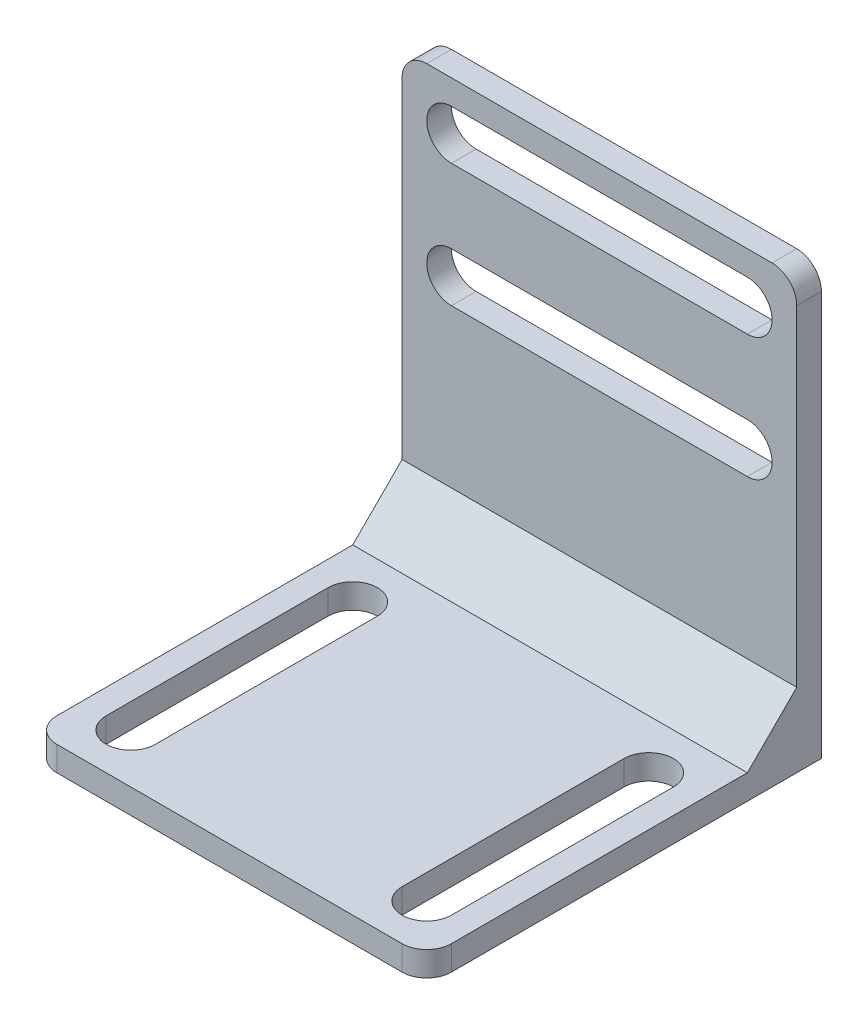
ISO-10303-21;
HEADER;
FILE_DESCRIPTION(('STEP AP214'),'2;1');
FILE_NAME('part.step','',(''),(''),'','','');
FILE_SCHEMA(('AUTOMOTIVE_DESIGN { 1 0 10303 214 1 1 1 1 }'));
ENDSEC;
DATA;
#1=APPLICATION_CONTEXT('core data for automotive mechanical design processes');
#2=APPLICATION_PROTOCOL_DEFINITION('international standard','automotive_design',2000,#1);
#3=PRODUCT_CONTEXT('',#1,'mechanical');
#4=PRODUCT('Part','Part','',(#3));
#5=PRODUCT_RELATED_PRODUCT_CATEGORY('part','',(#4));
#6=PRODUCT_DEFINITION_FORMATION('','',#4);
#7=PRODUCT_DEFINITION_CONTEXT('part definition',#1,'design');
#8=PRODUCT_DEFINITION('design','',#6,#7);
#9=PRODUCT_DEFINITION_SHAPE('','',#8);
#10=(LENGTH_UNIT() NAMED_UNIT(*) SI_UNIT(.MILLI.,.METRE.));
#11=(NAMED_UNIT(*) PLANE_ANGLE_UNIT() SI_UNIT($,.RADIAN.));
#12=(NAMED_UNIT(*) SI_UNIT($,.STERADIAN.) SOLID_ANGLE_UNIT());
#13=UNCERTAINTY_MEASURE_WITH_UNIT(LENGTH_MEASURE(1.E-05),#10,'distance_accuracy_value','');
#14=(GEOMETRIC_REPRESENTATION_CONTEXT(3) GLOBAL_UNCERTAINTY_ASSIGNED_CONTEXT((#13)) GLOBAL_UNIT_ASSIGNED_CONTEXT((#10,
#11,#12)) REPRESENTATION_CONTEXT('',''));
#15=CARTESIAN_POINT('',(0.,0.,0.));
#16=DIRECTION('',(0.,0.,1.));
#17=DIRECTION('',(1.,0.,0.));
#18=AXIS2_PLACEMENT_3D('',#15,#16,#17);
#19=CARTESIAN_POINT('',(0.,5.,0.));
#20=DIRECTION('',(0.,1.,0.));
#21=DIRECTION('',(0.,0.,1.));
#22=AXIS2_PLACEMENT_3D('',#19,#20,#21);
#23=PLANE('',#22);
#24=CARTESIAN_POINT('',(-30.,5.,30.));
#25=DIRECTION('',(0.,1.,0.));
#26=DIRECTION('',(0.,0.,1.));
#27=AXIS2_PLACEMENT_3D('',#24,#25,#26);
#28=CIRCLE('',#27,5.);
#29=CARTESIAN_POINT('',(-35.,5.,30.));
#30=VERTEX_POINT('',#29);
#31=CARTESIAN_POINT('',(-25.,5.,30.));
#32=VERTEX_POINT('',#31);
#33=EDGE_CURVE('E218',#30,#32,#28,.T.);
#34=ORIENTED_EDGE('',*,*,#33,.F.);
#35=DIRECTION('',(0.,0.,1.));
#36=VECTOR('',#35,1.);
#37=CARTESIAN_POINT('',(-35.,5.,30.));
#38=LINE('',#37,#36);
#39=CARTESIAN_POINT('',(-35.,5.,-15.));
#40=VERTEX_POINT('',#39);
#41=EDGE_CURVE('E236',#40,#30,#38,.T.);
#42=ORIENTED_EDGE('',*,*,#41,.F.);
#43=CARTESIAN_POINT('',(-30.,5.,-15.));
#44=DIRECTION('',(0.,1.,0.));
#45=DIRECTION('',(0.,0.,1.));
#46=AXIS2_PLACEMENT_3D('',#43,#44,#45);
#47=CIRCLE('',#46,5.);
#48=CARTESIAN_POINT('',(-25.,5.,-15.));
#49=VERTEX_POINT('',#48);
#50=EDGE_CURVE('E239',#49,#40,#47,.T.);
#51=ORIENTED_EDGE('',*,*,#50,.F.);
#52=DIRECTION('',(0.,0.,-1.));
#53=VECTOR('',#52,1.);
#54=CARTESIAN_POINT('',(-25.,5.,30.));
#55=LINE('',#54,#53);
#56=EDGE_CURVE('E247',#32,#49,#55,.T.);
#57=ORIENTED_EDGE('',*,*,#56,.F.);
#58=EDGE_LOOP('',(#34,#42,#51,#57));
#59=FACE_BOUND('',#58,.T.);
#60=CARTESIAN_POINT('',(30.,5.,-15.));
#61=DIRECTION('',(0.,1.,0.));
#62=DIRECTION('',(0.,0.,1.));
#63=AXIS2_PLACEMENT_3D('',#60,#61,#62);
#64=CIRCLE('',#63,5.);
#65=CARTESIAN_POINT('',(35.,5.,-15.));
#66=VERTEX_POINT('',#65);
#67=CARTESIAN_POINT('',(25.,5.,-15.));
#68=VERTEX_POINT('',#67);
#69=EDGE_CURVE('E272',#66,#68,#64,.T.);
#70=ORIENTED_EDGE('',*,*,#69,.F.);
#71=DIRECTION('',(0.,0.,-1.));
#72=VECTOR('',#71,1.);
#73=CARTESIAN_POINT('',(35.,5.,-15.));
#74=LINE('',#73,#72);
#75=CARTESIAN_POINT('',(35.,5.,30.));
#76=VERTEX_POINT('',#75);
#77=EDGE_CURVE('E262',#76,#66,#74,.T.);
#78=ORIENTED_EDGE('',*,*,#77,.F.);
#79=CARTESIAN_POINT('',(30.,5.,30.));
#80=DIRECTION('',(0.,1.,0.));
#81=DIRECTION('',(0.,0.,1.));
#82=AXIS2_PLACEMENT_3D('',#79,#80,#81);
#83=CIRCLE('',#82,5.00000000000001);
#84=CARTESIAN_POINT('',(25.,5.,30.));
#85=VERTEX_POINT('',#84);
#86=EDGE_CURVE('E278',#85,#76,#83,.T.);
#87=ORIENTED_EDGE('',*,*,#86,.F.);
#88=DIRECTION('',(0.,0.,1.));
#89=VECTOR('',#88,1.);
#90=CARTESIAN_POINT('',(25.,5.,-15.));
#91=LINE('',#90,#89);
#92=EDGE_CURVE('E274',#68,#85,#91,.T.);
#93=ORIENTED_EDGE('',*,*,#92,.F.);
#94=EDGE_LOOP('',(#70,#78,#87,#93));
#95=FACE_BOUND('',#94,.T.);
#96=DIRECTION('',(0.,0.,-1.));
#97=VECTOR('',#96,1.);
#98=CARTESIAN_POINT('',(40.,5.,-40.));
#99=LINE('',#98,#97);
#100=CARTESIAN_POINT('',(40.,5.,35.));
#101=VERTEX_POINT('',#100);
#102=CARTESIAN_POINT('',(40.,5.,-25.));
#103=VERTEX_POINT('',#102);
#104=EDGE_CURVE('E50',#101,#103,#99,.T.);
#105=ORIENTED_EDGE('',*,*,#104,.T.);
#106=DIRECTION('',(1.,0.,0.));
#107=VECTOR('',#106,1.);
#108=CARTESIAN_POINT('',(-54.142135623731,5.,-25.));
#109=LINE('',#108,#107);
#110=CARTESIAN_POINT('',(-40.,5.,-25.));
#111=VERTEX_POINT('',#110);
#112=EDGE_CURVE('E54',#111,#103,#109,.T.);
#113=ORIENTED_EDGE('',*,*,#112,.F.);
#114=DIRECTION('',(0.,0.,1.));
#115=VECTOR('',#114,1.);
#116=CARTESIAN_POINT('',(-40.,5.,-40.));
#117=LINE('',#116,#115);
#118=CARTESIAN_POINT('',(-40.,5.,35.));
#119=VERTEX_POINT('',#118);
#120=EDGE_CURVE('E342',#111,#119,#117,.T.);
#121=ORIENTED_EDGE('',*,*,#120,.T.);
#122=CARTESIAN_POINT('',(-35.,5.,35.));
#123=DIRECTION('',(0.,1.,0.));
#124=DIRECTION('',(0.,0.,1.));
#125=AXIS2_PLACEMENT_3D('',#122,#123,#124);
#126=CIRCLE('',#125,5.);
#127=CARTESIAN_POINT('',(-35.,5.,40.));
#128=VERTEX_POINT('',#127);
#129=EDGE_CURVE('E400',#119,#128,#126,.T.);
#130=ORIENTED_EDGE('',*,*,#129,.T.);
#131=DIRECTION('',(1.,0.,0.));
#132=VECTOR('',#131,1.);
#133=CARTESIAN_POINT('',(-40.,5.,40.));
#134=LINE('',#133,#132);
#135=CARTESIAN_POINT('',(35.,5.,40.));
#136=VERTEX_POINT('',#135);
#137=EDGE_CURVE('E345',#128,#136,#134,.T.);
#138=ORIENTED_EDGE('',*,*,#137,.T.);
#139=CARTESIAN_POINT('',(35.,5.,35.));
#140=DIRECTION('',(0.,1.,0.));
#141=DIRECTION('',(0.,0.,1.));
#142=AXIS2_PLACEMENT_3D('',#139,#140,#141);
#143=CIRCLE('',#142,5.);
#144=EDGE_CURVE('E398',#136,#101,#143,.T.);
#145=ORIENTED_EDGE('',*,*,#144,.T.);
#146=EDGE_LOOP('',(#105,#113,#121,#130,#138,#145));
#147=FACE_BOUND('',#146,.T.);
#148=ADVANCED_FACE('F35',(#59,#95,#147),#23,.T.);
#149=CARTESIAN_POINT('',(-40.,87.,-35.));
#150=DIRECTION('',(0.,0.,-1.));
#151=DIRECTION('',(-1.,0.,0.));
#152=AXIS2_PLACEMENT_3D('',#149,#150,#151);
#153=PLANE('',#152);
#154=DIRECTION('',(1.,0.,0.));
#155=VECTOR('',#154,1.);
#156=CARTESIAN_POINT('',(-40.,57.,-35.));
#157=LINE('',#156,#155);
#158=CARTESIAN_POINT('',(-30.,57.,-35.));
#159=VERTEX_POINT('',#158);
#160=CARTESIAN_POINT('',(30.,57.,-35.));
#161=VERTEX_POINT('',#160);
#162=EDGE_CURVE('E368',#159,#161,#157,.T.);
#163=ORIENTED_EDGE('',*,*,#162,.T.);
#164=CARTESIAN_POINT('',(30.,52.,-35.));
#165=DIRECTION('',(0.,0.,-1.));
#166=DIRECTION('',(-1.,0.,0.));
#167=AXIS2_PLACEMENT_3D('',#164,#165,#166);
#168=CIRCLE('',#167,5.);
#169=CARTESIAN_POINT('',(30.,47.,-35.));
#170=VERTEX_POINT('',#169);
#171=EDGE_CURVE('E371',#161,#170,#168,.T.);
#172=ORIENTED_EDGE('',*,*,#171,.T.);
#173=DIRECTION('',(-1.,0.,0.));
#174=VECTOR('',#173,1.);
#175=CARTESIAN_POINT('',(-40.,47.,-35.));
#176=LINE('',#175,#174);
#177=CARTESIAN_POINT('',(-30.,47.,-35.));
#178=VERTEX_POINT('',#177);
#179=EDGE_CURVE('E362',#170,#178,#176,.T.);
#180=ORIENTED_EDGE('',*,*,#179,.T.);
#181=CARTESIAN_POINT('',(-30.,52.,-35.));
#182=DIRECTION('',(0.,0.,-1.));
#183=DIRECTION('',(-1.,0.,0.));
#184=AXIS2_PLACEMENT_3D('',#181,#182,#183);
#185=CIRCLE('',#184,5.);
#186=EDGE_CURVE('E365',#178,#159,#185,.T.);
#187=ORIENTED_EDGE('',*,*,#186,.T.);
#188=EDGE_LOOP('',(#163,#172,#180,#187));
#189=FACE_BOUND('',#188,.T.);
#190=DIRECTION('',(1.,0.,0.));
#191=VECTOR('',#190,1.);
#192=CARTESIAN_POINT('',(-40.,82.,-35.));
#193=LINE('',#192,#191);
#194=CARTESIAN_POINT('',(-30.,82.,-35.));
#195=VERTEX_POINT('',#194);
#196=CARTESIAN_POINT('',(30.,82.,-35.));
#197=VERTEX_POINT('',#196);
#198=EDGE_CURVE('E380',#195,#197,#193,.T.);
#199=ORIENTED_EDGE('',*,*,#198,.T.);
#200=CARTESIAN_POINT('',(30.,77.,-35.));
#201=DIRECTION('',(0.,0.,-1.));
#202=DIRECTION('',(-1.,0.,0.));
#203=AXIS2_PLACEMENT_3D('',#200,#201,#202);
#204=CIRCLE('',#203,5.);
#205=CARTESIAN_POINT('',(30.,72.,-35.));
#206=VERTEX_POINT('',#205);
#207=EDGE_CURVE('E383',#197,#206,#204,.T.);
#208=ORIENTED_EDGE('',*,*,#207,.T.);
#209=DIRECTION('',(-1.,0.,0.));
#210=VECTOR('',#209,1.);
#211=CARTESIAN_POINT('',(-40.,72.,-35.));
#212=LINE('',#211,#210);
#213=CARTESIAN_POINT('',(-30.,72.,-35.));
#214=VERTEX_POINT('',#213);
#215=EDGE_CURVE('E374',#206,#214,#212,.T.);
#216=ORIENTED_EDGE('',*,*,#215,.T.);
#217=CARTESIAN_POINT('',(-30.,77.,-35.));
#218=DIRECTION('',(0.,0.,-1.));
#219=DIRECTION('',(-1.,0.,0.));
#220=AXIS2_PLACEMENT_3D('',#217,#218,#219);
#221=CIRCLE('',#220,5.);
#222=EDGE_CURVE('E377',#214,#195,#221,.T.);
#223=ORIENTED_EDGE('',*,*,#222,.T.);
#224=EDGE_LOOP('',(#199,#208,#216,#223));
#225=FACE_BOUND('',#224,.T.);
#226=DIRECTION('',(1.,0.,0.));
#227=VECTOR('',#226,1.);
#228=CARTESIAN_POINT('',(-54.142135623731,15.,-35.));
#229=LINE('',#228,#227);
#230=CARTESIAN_POINT('',(-40.,15.,-35.));
#231=VERTEX_POINT('',#230);
#232=CARTESIAN_POINT('',(40.,15.0000000000001,-35.));
#233=VERTEX_POINT('',#232);
#234=EDGE_CURVE('E440',#231,#233,#229,.T.);
#235=ORIENTED_EDGE('',*,*,#234,.T.);
#236=DIRECTION('',(0.,-1.,0.));
#237=VECTOR('',#236,1.);
#238=CARTESIAN_POINT('',(40.,87.,-35.));
#239=LINE('',#238,#237);
#240=CARTESIAN_POINT('',(40.,82.,-35.));
#241=VERTEX_POINT('',#240);
#242=EDGE_CURVE('E335',#241,#233,#239,.T.);
#243=ORIENTED_EDGE('',*,*,#242,.F.);
#244=CARTESIAN_POINT('',(35.,82.,-35.));
#245=DIRECTION('',(0.,0.,-1.));
#246=DIRECTION('',(-1.,0.,0.));
#247=AXIS2_PLACEMENT_3D('',#244,#245,#246);
#248=CIRCLE('',#247,5.);
#249=CARTESIAN_POINT('',(35.,87.,-35.));
#250=VERTEX_POINT('',#249);
#251=EDGE_CURVE('E411',#241,#250,#248,.F.);
#252=ORIENTED_EDGE('',*,*,#251,.T.);
#253=DIRECTION('',(1.,0.,0.));
#254=VECTOR('',#253,1.);
#255=CARTESIAN_POINT('',(-40.,87.,-35.));
#256=LINE('',#255,#254);
#257=CARTESIAN_POINT('',(-35.,87.,-35.));
#258=VERTEX_POINT('',#257);
#259=EDGE_CURVE('E305',#258,#250,#256,.T.);
#260=ORIENTED_EDGE('',*,*,#259,.F.);
#261=CARTESIAN_POINT('',(-35.,82.,-35.));
#262=DIRECTION('',(0.,0.,-1.));
#263=DIRECTION('',(-1.,0.,0.));
#264=AXIS2_PLACEMENT_3D('',#261,#262,#263);
#265=CIRCLE('',#264,5.);
#266=CARTESIAN_POINT('',(-40.,82.,-35.));
#267=VERTEX_POINT('',#266);
#268=EDGE_CURVE('E413',#258,#267,#265,.F.);
#269=ORIENTED_EDGE('',*,*,#268,.T.);
#270=DIRECTION('',(0.,-1.,0.));
#271=VECTOR('',#270,1.);
#272=CARTESIAN_POINT('',(-40.,87.,-35.));
#273=LINE('',#272,#271);
#274=EDGE_CURVE('E338',#267,#231,#273,.T.);
#275=ORIENTED_EDGE('',*,*,#274,.T.);
#276=EDGE_LOOP('',(#235,#243,#252,#260,#269,#275));
#277=FACE_BOUND('',#276,.T.);
#278=ADVANCED_FACE('F433',(#189,#225,#277),#153,.F.);
#279=CARTESIAN_POINT('',(40.,5.,-40.));
#280=DIRECTION('',(-1.,0.,0.));
#281=DIRECTION('',(0.,0.,1.));
#282=AXIS2_PLACEMENT_3D('',#279,#280,#281);
#283=PLANE('',#282);
#284=DIRECTION('',(0.,0.707106781186549,-0.707106781186546));
#285=VECTOR('',#284,1.);
#286=CARTESIAN_POINT('',(40.,-10.,-10.));
#287=LINE('',#286,#285);
#288=EDGE_CURVE('E445',#103,#233,#287,.T.);
#289=ORIENTED_EDGE('',*,*,#288,.F.);
#290=ORIENTED_EDGE('',*,*,#104,.F.);
#291=DIRECTION('',(0.,-1.,0.));
#292=VECTOR('',#291,1.);
#293=CARTESIAN_POINT('',(40.,5.,35.));
#294=LINE('',#293,#292);
#295=CARTESIAN_POINT('',(40.,0.,35.));
#296=VERTEX_POINT('',#295);
#297=EDGE_CURVE('E402',#101,#296,#294,.T.);
#298=ORIENTED_EDGE('',*,*,#297,.T.);
#299=DIRECTION('',(0.,0.,-1.));
#300=VECTOR('',#299,1.);
#301=CARTESIAN_POINT('',(40.,0.,-40.));
#302=LINE('',#301,#300);
#303=CARTESIAN_POINT('',(40.,0.,-40.));
#304=VERTEX_POINT('',#303);
#305=EDGE_CURVE('E340',#296,#304,#302,.T.);
#306=ORIENTED_EDGE('',*,*,#305,.T.);
#307=DIRECTION('',(0.,-1.,0.));
#308=VECTOR('',#307,1.);
#309=CARTESIAN_POINT('',(40.,5.,-40.));
#310=LINE('',#309,#308);
#311=CARTESIAN_POINT('',(40.,82.,-40.));
#312=VERTEX_POINT('',#311);
#313=EDGE_CURVE('E360',#312,#304,#310,.T.);
#314=ORIENTED_EDGE('',*,*,#313,.F.);
#315=DIRECTION('',(0.,0.,-1.));
#316=VECTOR('',#315,1.);
#317=CARTESIAN_POINT('',(40.,82.,-35.));
#318=LINE('',#317,#316);
#319=EDGE_CURVE('E11',#312,#241,#318,.F.);
#320=ORIENTED_EDGE('',*,*,#319,.T.);
#321=ORIENTED_EDGE('',*,*,#242,.T.);
#322=EDGE_LOOP('',(#289,#290,#298,#306,#314,#320,#321));
#323=FACE_BOUND('',#322,.T.);
#324=ADVANCED_FACE('F449',(#323),#283,.F.);
#325=CARTESIAN_POINT('',(-40.,5.,-40.));
#326=DIRECTION('',(0.,0.,1.));
#327=DIRECTION('',(1.,0.,0.));
#328=AXIS2_PLACEMENT_3D('',#325,#326,#327);
#329=PLANE('',#328);
#330=DIRECTION('',(-1.,0.,0.));
#331=VECTOR('',#330,1.);
#332=CARTESIAN_POINT('',(30.,72.,-40.));
#333=LINE('',#332,#331);
#334=CARTESIAN_POINT('',(30.,72.,-40.));
#335=VERTEX_POINT('',#334);
#336=CARTESIAN_POINT('',(-30.,72.,-40.));
#337=VERTEX_POINT('',#336);
#338=EDGE_CURVE('E292',#335,#337,#333,.T.);
#339=ORIENTED_EDGE('',*,*,#338,.F.);
#340=CARTESIAN_POINT('',(30.,77.,-40.));
#341=DIRECTION('',(0.,0.,-1.));
#342=DIRECTION('',(-1.,0.,0.));
#343=AXIS2_PLACEMENT_3D('',#340,#341,#342);
#344=CIRCLE('',#343,5.);
#345=CARTESIAN_POINT('',(30.,82.,-40.));
#346=VERTEX_POINT('',#345);
#347=EDGE_CURVE('E290',#346,#335,#344,.T.);
#348=ORIENTED_EDGE('',*,*,#347,.F.);
#349=DIRECTION('',(1.,0.,0.));
#350=VECTOR('',#349,1.);
#351=CARTESIAN_POINT('',(30.,82.,-40.));
#352=LINE('',#351,#350);
#353=CARTESIAN_POINT('',(-30.,82.,-40.));
#354=VERTEX_POINT('',#353);
#355=EDGE_CURVE('E299',#354,#346,#352,.T.);
#356=ORIENTED_EDGE('',*,*,#355,.F.);
#357=CARTESIAN_POINT('',(-30.,77.,-40.));
#358=DIRECTION('',(0.,0.,-1.));
#359=DIRECTION('',(-1.,0.,0.));
#360=AXIS2_PLACEMENT_3D('',#357,#358,#359);
#361=CIRCLE('',#360,5.);
#362=EDGE_CURVE('E296',#337,#354,#361,.T.);
#363=ORIENTED_EDGE('',*,*,#362,.F.);
#364=EDGE_LOOP('',(#339,#348,#356,#363));
#365=FACE_BOUND('',#364,.T.);
#366=DIRECTION('',(-1.,0.,0.));
#367=VECTOR('',#366,1.);
#368=CARTESIAN_POINT('',(30.,47.,-40.));
#369=LINE('',#368,#367);
#370=CARTESIAN_POINT('',(30.,47.,-40.));
#371=VERTEX_POINT('',#370);
#372=CARTESIAN_POINT('',(-30.,47.,-40.));
#373=VERTEX_POINT('',#372);
#374=EDGE_CURVE('E313',#371,#373,#369,.T.);
#375=ORIENTED_EDGE('',*,*,#374,.F.);
#376=CARTESIAN_POINT('',(30.,52.,-40.));
#377=DIRECTION('',(0.,0.,-1.));
#378=DIRECTION('',(-1.,0.,0.));
#379=AXIS2_PLACEMENT_3D('',#376,#377,#378);
#380=CIRCLE('',#379,5.);
#381=CARTESIAN_POINT('',(30.,57.,-40.));
#382=VERTEX_POINT('',#381);
#383=EDGE_CURVE('E254',#382,#371,#380,.T.);
#384=ORIENTED_EDGE('',*,*,#383,.F.);
#385=DIRECTION('',(1.,0.,0.));
#386=VECTOR('',#385,1.);
#387=CARTESIAN_POINT('',(30.,57.,-40.));
#388=LINE('',#387,#386);
#389=CARTESIAN_POINT('',(-30.,57.,-40.));
#390=VERTEX_POINT('',#389);
#391=EDGE_CURVE('E319',#390,#382,#388,.T.);
#392=ORIENTED_EDGE('',*,*,#391,.F.);
#393=CARTESIAN_POINT('',(-30.,52.,-40.));
#394=DIRECTION('',(0.,0.,-1.));
#395=DIRECTION('',(-1.,0.,0.));
#396=AXIS2_PLACEMENT_3D('',#393,#394,#395);
#397=CIRCLE('',#396,5.);
#398=EDGE_CURVE('E316',#373,#390,#397,.T.);
#399=ORIENTED_EDGE('',*,*,#398,.F.);
#400=EDGE_LOOP('',(#375,#384,#392,#399));
#401=FACE_BOUND('',#400,.T.);
#402=DIRECTION('',(0.,-1.,0.));
#403=VECTOR('',#402,1.);
#404=CARTESIAN_POINT('',(-40.,5.,-40.));
#405=LINE('',#404,#403);
#406=CARTESIAN_POINT('',(-40.,82.,-40.));
#407=VERTEX_POINT('',#406);
#408=CARTESIAN_POINT('',(-40.,0.,-40.));
#409=VERTEX_POINT('',#408);
#410=EDGE_CURVE('E348',#407,#409,#405,.T.);
#411=ORIENTED_EDGE('',*,*,#410,.F.);
#412=CARTESIAN_POINT('',(-35.,82.,-40.));
#413=DIRECTION('',(0.,0.,1.));
#414=DIRECTION('',(1.,0.,0.));
#415=AXIS2_PLACEMENT_3D('',#412,#413,#414);
#416=CIRCLE('',#415,5.);
#417=CARTESIAN_POINT('',(-35.,87.,-40.));
#418=VERTEX_POINT('',#417);
#419=EDGE_CURVE('E43',#407,#418,#416,.F.);
#420=ORIENTED_EDGE('',*,*,#419,.T.);
#421=DIRECTION('',(-1.,0.,0.));
#422=VECTOR('',#421,1.);
#423=CARTESIAN_POINT('',(-40.,87.,-40.));
#424=LINE('',#423,#422);
#425=CARTESIAN_POINT('',(35.,87.,-40.));
#426=VERTEX_POINT('',#425);
#427=EDGE_CURVE('E332',#426,#418,#424,.T.);
#428=ORIENTED_EDGE('',*,*,#427,.F.);
#429=CARTESIAN_POINT('',(35.,82.,-40.));
#430=DIRECTION('',(0.,0.,1.));
#431=DIRECTION('',(1.,0.,0.));
#432=AXIS2_PLACEMENT_3D('',#429,#430,#431);
#433=CIRCLE('',#432,5.);
#434=EDGE_CURVE('E417',#426,#312,#433,.F.);
#435=ORIENTED_EDGE('',*,*,#434,.T.);
#436=ORIENTED_EDGE('',*,*,#313,.T.);
#437=DIRECTION('',(-1.,0.,0.));
#438=VECTOR('',#437,1.);
#439=CARTESIAN_POINT('',(-40.,0.,-40.));
#440=LINE('',#439,#438);
#441=EDGE_CURVE('E351',#304,#409,#440,.T.);
#442=ORIENTED_EDGE('',*,*,#441,.T.);
#443=EDGE_LOOP('',(#411,#420,#428,#435,#436,#442));
#444=FACE_BOUND('',#443,.T.);
#445=ADVANCED_FACE('F422',(#365,#401,#444),#329,.F.);
#446=CARTESIAN_POINT('',(-40.,5.,-40.));
#447=DIRECTION('',(1.,0.,0.));
#448=DIRECTION('',(0.,0.,-1.));
#449=AXIS2_PLACEMENT_3D('',#446,#447,#448);
#450=PLANE('',#449);
#451=ORIENTED_EDGE('',*,*,#120,.F.);
#452=DIRECTION('',(0.,-0.707106781186549,0.707106781186546));
#453=VECTOR('',#452,1.);
#454=CARTESIAN_POINT('',(-40.,-9.99999999999999,-10.));
#455=LINE('',#454,#453);
#456=EDGE_CURVE('E275',#231,#111,#455,.T.);
#457=ORIENTED_EDGE('',*,*,#456,.F.);
#458=ORIENTED_EDGE('',*,*,#274,.F.);
#459=DIRECTION('',(0.,0.,1.));
#460=VECTOR('',#459,1.);
#461=CARTESIAN_POINT('',(-40.,82.,-40.));
#462=LINE('',#461,#460);
#463=EDGE_CURVE('E415',#267,#407,#462,.F.);
#464=ORIENTED_EDGE('',*,*,#463,.T.);
#465=ORIENTED_EDGE('',*,*,#410,.T.);
#466=DIRECTION('',(0.,0.,1.));
#467=VECTOR('',#466,1.);
#468=CARTESIAN_POINT('',(-40.,0.,-40.));
#469=LINE('',#468,#467);
#470=CARTESIAN_POINT('',(-40.,0.,35.));
#471=VERTEX_POINT('',#470);
#472=EDGE_CURVE('E354',#409,#471,#469,.T.);
#473=ORIENTED_EDGE('',*,*,#472,.T.);
#474=DIRECTION('',(0.,-1.,0.));
#475=VECTOR('',#474,1.);
#476=CARTESIAN_POINT('',(-40.,5.,35.));
#477=LINE('',#476,#475);
#478=EDGE_CURVE('E395',#471,#119,#477,.F.);
#479=ORIENTED_EDGE('',*,*,#478,.T.);
#480=EDGE_LOOP('',(#451,#457,#458,#464,#465,#473,#479));
#481=FACE_BOUND('',#480,.T.);
#482=ADVANCED_FACE('F436',(#481),#450,.F.);
#483=CARTESIAN_POINT('',(-40.,5.,40.));
#484=DIRECTION('',(0.,0.,-1.));
#485=DIRECTION('',(-1.,0.,0.));
#486=AXIS2_PLACEMENT_3D('',#483,#484,#485);
#487=PLANE('',#486);
#488=ORIENTED_EDGE('',*,*,#137,.F.);
#489=DIRECTION('',(0.,-1.,0.));
#490=VECTOR('',#489,1.);
#491=CARTESIAN_POINT('',(-35.,5.,40.));
#492=LINE('',#491,#490);
#493=CARTESIAN_POINT('',(-35.,0.,40.));
#494=VERTEX_POINT('',#493);
#495=EDGE_CURVE('E388',#128,#494,#492,.T.);
#496=ORIENTED_EDGE('',*,*,#495,.T.);
#497=DIRECTION('',(1.,0.,0.));
#498=VECTOR('',#497,1.);
#499=CARTESIAN_POINT('',(-40.,0.,40.));
#500=LINE('',#499,#498);
#501=CARTESIAN_POINT('',(35.,0.,40.));
#502=VERTEX_POINT('',#501);
#503=EDGE_CURVE('E343',#494,#502,#500,.T.);
#504=ORIENTED_EDGE('',*,*,#503,.T.);
#505=DIRECTION('',(0.,-1.,0.));
#506=VECTOR('',#505,1.);
#507=CARTESIAN_POINT('',(35.,5.,40.));
#508=LINE('',#507,#506);
#509=EDGE_CURVE('E386',#502,#136,#508,.F.);
#510=ORIENTED_EDGE('',*,*,#509,.T.);
#511=EDGE_LOOP('',(#488,#496,#504,#510));
#512=FACE_BOUND('',#511,.T.);
#513=ADVANCED_FACE('F468',(#512),#487,.F.);
#514=CARTESIAN_POINT('',(0.,0.,0.));
#515=DIRECTION('',(0.,1.,0.));
#516=DIRECTION('',(0.,0.,1.));
#517=AXIS2_PLACEMENT_3D('',#514,#515,#516);
#518=PLANE('',#517);
#519=DIRECTION('',(0.,0.,1.));
#520=VECTOR('',#519,1.);
#521=CARTESIAN_POINT('',(-35.,0.,30.));
#522=LINE('',#521,#520);
#523=CARTESIAN_POINT('',(-35.,0.,-15.));
#524=VERTEX_POINT('',#523);
#525=CARTESIAN_POINT('',(-35.,0.,30.));
#526=VERTEX_POINT('',#525);
#527=EDGE_CURVE('E223',#524,#526,#522,.T.);
#528=ORIENTED_EDGE('',*,*,#527,.T.);
#529=CARTESIAN_POINT('',(-30.,0.,30.));
#530=DIRECTION('',(0.,1.,0.));
#531=DIRECTION('',(0.,0.,1.));
#532=AXIS2_PLACEMENT_3D('',#529,#530,#531);
#533=CIRCLE('',#532,5.);
#534=CARTESIAN_POINT('',(-25.,0.,30.));
#535=VERTEX_POINT('',#534);
#536=EDGE_CURVE('E215',#526,#535,#533,.T.);
#537=ORIENTED_EDGE('',*,*,#536,.T.);
#538=DIRECTION('',(0.,0.,-1.));
#539=VECTOR('',#538,1.);
#540=CARTESIAN_POINT('',(-25.,0.,30.));
#541=LINE('',#540,#539);
#542=CARTESIAN_POINT('',(-25.,0.,-15.));
#543=VERTEX_POINT('',#542);
#544=EDGE_CURVE('E227',#535,#543,#541,.T.);
#545=ORIENTED_EDGE('',*,*,#544,.T.);
#546=CARTESIAN_POINT('',(-30.,0.,-15.));
#547=DIRECTION('',(0.,1.,0.));
#548=DIRECTION('',(0.,0.,1.));
#549=AXIS2_PLACEMENT_3D('',#546,#547,#548);
#550=CIRCLE('',#549,5.);
#551=EDGE_CURVE('E231',#543,#524,#550,.T.);
#552=ORIENTED_EDGE('',*,*,#551,.T.);
#553=EDGE_LOOP('',(#528,#537,#545,#552));
#554=FACE_BOUND('',#553,.T.);
#555=DIRECTION('',(0.,0.,-1.));
#556=VECTOR('',#555,1.);
#557=CARTESIAN_POINT('',(35.,0.,-15.));
#558=LINE('',#557,#556);
#559=CARTESIAN_POINT('',(35.,0.,30.));
#560=VERTEX_POINT('',#559);
#561=CARTESIAN_POINT('',(35.,0.,-15.));
#562=VERTEX_POINT('',#561);
#563=EDGE_CURVE('E268',#560,#562,#558,.T.);
#564=ORIENTED_EDGE('',*,*,#563,.T.);
#565=CARTESIAN_POINT('',(30.,0.,-15.));
#566=DIRECTION('',(0.,1.,0.));
#567=DIRECTION('',(0.,0.,1.));
#568=AXIS2_PLACEMENT_3D('',#565,#566,#567);
#569=CIRCLE('',#568,5.);
#570=CARTESIAN_POINT('',(25.,0.,-15.));
#571=VERTEX_POINT('',#570);
#572=EDGE_CURVE('E258',#562,#571,#569,.T.);
#573=ORIENTED_EDGE('',*,*,#572,.T.);
#574=DIRECTION('',(0.,0.,1.));
#575=VECTOR('',#574,1.);
#576=CARTESIAN_POINT('',(25.,0.,-15.));
#577=LINE('',#576,#575);
#578=CARTESIAN_POINT('',(25.,0.,30.));
#579=VERTEX_POINT('',#578);
#580=EDGE_CURVE('E261',#571,#579,#577,.T.);
#581=ORIENTED_EDGE('',*,*,#580,.T.);
#582=CARTESIAN_POINT('',(30.,0.,30.));
#583=DIRECTION('',(0.,1.,0.));
#584=DIRECTION('',(0.,0.,1.));
#585=AXIS2_PLACEMENT_3D('',#582,#583,#584);
#586=CIRCLE('',#585,5.00000000000001);
#587=EDGE_CURVE('E265',#579,#560,#586,.T.);
#588=ORIENTED_EDGE('',*,*,#587,.T.);
#589=EDGE_LOOP('',(#564,#573,#581,#588));
#590=FACE_BOUND('',#589,.T.);
#591=ORIENTED_EDGE('',*,*,#503,.F.);
#592=CARTESIAN_POINT('',(-35.,0.,35.));
#593=DIRECTION('',(0.,1.,0.));
#594=DIRECTION('',(0.,0.,1.));
#595=AXIS2_PLACEMENT_3D('',#592,#593,#594);
#596=CIRCLE('',#595,5.);
#597=EDGE_CURVE('E393',#494,#471,#596,.F.);
#598=ORIENTED_EDGE('',*,*,#597,.T.);
#599=ORIENTED_EDGE('',*,*,#472,.F.);
#600=ORIENTED_EDGE('',*,*,#441,.F.);
#601=ORIENTED_EDGE('',*,*,#305,.F.);
#602=CARTESIAN_POINT('',(35.,0.,35.));
#603=DIRECTION('',(0.,1.,0.));
#604=DIRECTION('',(0.,0.,1.));
#605=AXIS2_PLACEMENT_3D('',#602,#603,#604);
#606=CIRCLE('',#605,5.);
#607=EDGE_CURVE('E391',#296,#502,#606,.F.);
#608=ORIENTED_EDGE('',*,*,#607,.T.);
#609=EDGE_LOOP('',(#591,#598,#599,#600,#601,#608));
#610=FACE_BOUND('',#609,.T.);
#611=ADVANCED_FACE('F233',(#554,#590,#610),#518,.F.);
#612=CARTESIAN_POINT('',(0.,87.,0.));
#613=DIRECTION('',(0.,1.,0.));
#614=DIRECTION('',(0.,0.,1.));
#615=AXIS2_PLACEMENT_3D('',#612,#613,#614);
#616=PLANE('',#615);
#617=ORIENTED_EDGE('',*,*,#427,.T.);
#618=DIRECTION('',(0.,0.,1.));
#619=VECTOR('',#618,1.);
#620=CARTESIAN_POINT('',(-35.,87.,-35.));
#621=LINE('',#620,#619);
#622=EDGE_CURVE('E408',#418,#258,#621,.T.);
#623=ORIENTED_EDGE('',*,*,#622,.T.);
#624=ORIENTED_EDGE('',*,*,#259,.T.);
#625=DIRECTION('',(0.,0.,-1.));
#626=VECTOR('',#625,1.);
#627=CARTESIAN_POINT('',(35.,87.,-40.));
#628=LINE('',#627,#626);
#629=EDGE_CURVE('E405',#250,#426,#628,.T.);
#630=ORIENTED_EDGE('',*,*,#629,.T.);
#631=EDGE_LOOP('',(#617,#623,#624,#630));
#632=FACE_BOUND('',#631,.T.);
#633=ADVANCED_FACE('F427',(#632),#616,.T.);
#634=CARTESIAN_POINT('',(30.,52.,40.));
#635=DIRECTION('',(0.,0.,-1.));
#636=DIRECTION('',(-1.,0.,0.));
#637=AXIS2_PLACEMENT_3D('',#634,#635,#636);
#638=CYLINDRICAL_SURFACE('',#637,5.);
#639=DIRECTION('',(0.,0.,-1.));
#640=VECTOR('',#639,1.);
#641=CARTESIAN_POINT('',(30.,57.,40.));
#642=LINE('',#641,#640);
#643=EDGE_CURVE('E293',#161,#382,#642,.T.);
#644=ORIENTED_EDGE('',*,*,#643,.T.);
#645=ORIENTED_EDGE('',*,*,#383,.T.);
#646=DIRECTION('',(0.,0.,-1.));
#647=VECTOR('',#646,1.);
#648=CARTESIAN_POINT('',(30.,47.,40.));
#649=LINE('',#648,#647);
#650=EDGE_CURVE('E322',#170,#371,#649,.T.);
#651=ORIENTED_EDGE('',*,*,#650,.F.);
#652=ORIENTED_EDGE('',*,*,#171,.F.);
#653=EDGE_LOOP('',(#644,#645,#651,#652));
#654=FACE_BOUND('',#653,.T.);
#655=ADVANCED_FACE('F529',(#654),#638,.F.);
#656=CARTESIAN_POINT('',(30.,57.,40.));
#657=DIRECTION('',(0.,1.,0.));
#658=DIRECTION('',(0.,0.,1.));
#659=AXIS2_PLACEMENT_3D('',#656,#657,#658);
#660=PLANE('',#659);
#661=DIRECTION('',(0.,0.,-1.));
#662=VECTOR('',#661,1.);
#663=CARTESIAN_POINT('',(-30.,57.,40.));
#664=LINE('',#663,#662);
#665=EDGE_CURVE('E324',#159,#390,#664,.T.);
#666=ORIENTED_EDGE('',*,*,#665,.T.);
#667=ORIENTED_EDGE('',*,*,#391,.T.);
#668=ORIENTED_EDGE('',*,*,#643,.F.);
#669=ORIENTED_EDGE('',*,*,#162,.F.);
#670=EDGE_LOOP('',(#666,#667,#668,#669));
#671=FACE_BOUND('',#670,.T.);
#672=ADVANCED_FACE('F536',(#671),#660,.F.);
#673=CARTESIAN_POINT('',(-30.,52.,40.));
#674=DIRECTION('',(0.,0.,-1.));
#675=DIRECTION('',(-1.,0.,0.));
#676=AXIS2_PLACEMENT_3D('',#673,#674,#675);
#677=CYLINDRICAL_SURFACE('',#676,5.);
#678=DIRECTION('',(0.,0.,-1.));
#679=VECTOR('',#678,1.);
#680=CARTESIAN_POINT('',(-30.,47.,40.));
#681=LINE('',#680,#679);
#682=EDGE_CURVE('E326',#178,#373,#681,.T.);
#683=ORIENTED_EDGE('',*,*,#682,.T.);
#684=ORIENTED_EDGE('',*,*,#398,.T.);
#685=ORIENTED_EDGE('',*,*,#665,.F.);
#686=ORIENTED_EDGE('',*,*,#186,.F.);
#687=EDGE_LOOP('',(#683,#684,#685,#686));
#688=FACE_BOUND('',#687,.T.);
#689=ADVANCED_FACE('F544',(#688),#677,.F.);
#690=CARTESIAN_POINT('',(30.,47.,40.));
#691=DIRECTION('',(0.,-1.,0.));
#692=DIRECTION('',(0.,0.,-1.));
#693=AXIS2_PLACEMENT_3D('',#690,#691,#692);
#694=PLANE('',#693);
#695=ORIENTED_EDGE('',*,*,#650,.T.);
#696=ORIENTED_EDGE('',*,*,#374,.T.);
#697=ORIENTED_EDGE('',*,*,#682,.F.);
#698=ORIENTED_EDGE('',*,*,#179,.F.);
#699=EDGE_LOOP('',(#695,#696,#697,#698));
#700=FACE_BOUND('',#699,.T.);
#701=ADVANCED_FACE('F552',(#700),#694,.F.);
#702=CARTESIAN_POINT('',(30.,77.,40.));
#703=DIRECTION('',(0.,0.,-1.));
#704=DIRECTION('',(-1.,0.,0.));
#705=AXIS2_PLACEMENT_3D('',#702,#703,#704);
#706=CYLINDRICAL_SURFACE('',#705,5.);
#707=DIRECTION('',(0.,0.,-1.));
#708=VECTOR('',#707,1.);
#709=CARTESIAN_POINT('',(30.,82.,40.));
#710=LINE('',#709,#708);
#711=EDGE_CURVE('E303',#197,#346,#710,.T.);
#712=ORIENTED_EDGE('',*,*,#711,.T.);
#713=ORIENTED_EDGE('',*,*,#347,.T.);
#714=DIRECTION('',(0.,0.,-1.));
#715=VECTOR('',#714,1.);
#716=CARTESIAN_POINT('',(30.,72.,40.));
#717=LINE('',#716,#715);
#718=EDGE_CURVE('E302',#206,#335,#717,.T.);
#719=ORIENTED_EDGE('',*,*,#718,.F.);
#720=ORIENTED_EDGE('',*,*,#207,.F.);
#721=EDGE_LOOP('',(#712,#713,#719,#720));
#722=FACE_BOUND('',#721,.T.);
#723=ADVANCED_FACE('F560',(#722),#706,.F.);
#724=CARTESIAN_POINT('',(30.,82.,40.));
#725=DIRECTION('',(0.,1.,0.));
#726=DIRECTION('',(0.,0.,1.));
#727=AXIS2_PLACEMENT_3D('',#724,#725,#726);
#728=PLANE('',#727);
#729=DIRECTION('',(0.,0.,-1.));
#730=VECTOR('',#729,1.);
#731=CARTESIAN_POINT('',(-30.,82.,40.));
#732=LINE('',#731,#730);
#733=EDGE_CURVE('E306',#195,#354,#732,.T.);
#734=ORIENTED_EDGE('',*,*,#733,.T.);
#735=ORIENTED_EDGE('',*,*,#355,.T.);
#736=ORIENTED_EDGE('',*,*,#711,.F.);
#737=ORIENTED_EDGE('',*,*,#198,.F.);
#738=EDGE_LOOP('',(#734,#735,#736,#737));
#739=FACE_BOUND('',#738,.T.);
#740=ADVANCED_FACE('F568',(#739),#728,.F.);
#741=CARTESIAN_POINT('',(-30.,77.,40.));
#742=DIRECTION('',(0.,0.,-1.));
#743=DIRECTION('',(-1.,0.,0.));
#744=AXIS2_PLACEMENT_3D('',#741,#742,#743);
#745=CYLINDRICAL_SURFACE('',#744,5.);
#746=DIRECTION('',(0.,0.,-1.));
#747=VECTOR('',#746,1.);
#748=CARTESIAN_POINT('',(-30.,72.,40.));
#749=LINE('',#748,#747);
#750=EDGE_CURVE('E308',#214,#337,#749,.T.);
#751=ORIENTED_EDGE('',*,*,#750,.T.);
#752=ORIENTED_EDGE('',*,*,#362,.T.);
#753=ORIENTED_EDGE('',*,*,#733,.F.);
#754=ORIENTED_EDGE('',*,*,#222,.F.);
#755=EDGE_LOOP('',(#751,#752,#753,#754));
#756=FACE_BOUND('',#755,.T.);
#757=ADVANCED_FACE('F576',(#756),#745,.F.);
#758=CARTESIAN_POINT('',(30.,72.,40.));
#759=DIRECTION('',(0.,-1.,0.));
#760=DIRECTION('',(0.,0.,-1.));
#761=AXIS2_PLACEMENT_3D('',#758,#759,#760);
#762=PLANE('',#761);
#763=ORIENTED_EDGE('',*,*,#718,.T.);
#764=ORIENTED_EDGE('',*,*,#338,.T.);
#765=ORIENTED_EDGE('',*,*,#750,.F.);
#766=ORIENTED_EDGE('',*,*,#215,.F.);
#767=EDGE_LOOP('',(#763,#764,#765,#766));
#768=FACE_BOUND('',#767,.T.);
#769=ADVANCED_FACE('F584',(#768),#762,.F.);
#770=CARTESIAN_POINT('',(30.,0.,-15.));
#771=DIRECTION('',(0.,1.,0.));
#772=DIRECTION('',(0.,0.,1.));
#773=AXIS2_PLACEMENT_3D('',#770,#771,#772);
#774=CYLINDRICAL_SURFACE('',#773,5.);
#775=ORIENTED_EDGE('',*,*,#69,.T.);
#776=DIRECTION('',(0.,1.,0.));
#777=VECTOR('',#776,1.);
#778=CARTESIAN_POINT('',(25.,0.,-15.));
#779=LINE('',#778,#777);
#780=EDGE_CURVE('E271',#571,#68,#779,.T.);
#781=ORIENTED_EDGE('',*,*,#780,.F.);
#782=ORIENTED_EDGE('',*,*,#572,.F.);
#783=DIRECTION('',(0.,1.,0.));
#784=VECTOR('',#783,1.);
#785=CARTESIAN_POINT('',(35.,0.,-15.));
#786=LINE('',#785,#784);
#787=EDGE_CURVE('E248',#562,#66,#786,.T.);
#788=ORIENTED_EDGE('',*,*,#787,.T.);
#789=EDGE_LOOP('',(#775,#781,#782,#788));
#790=FACE_BOUND('',#789,.T.);
#791=ADVANCED_FACE('F592',(#790),#774,.F.);
#792=CARTESIAN_POINT('',(35.,0.,-15.));
#793=DIRECTION('',(1.,0.,0.));
#794=DIRECTION('',(0.,0.,-1.));
#795=AXIS2_PLACEMENT_3D('',#792,#793,#794);
#796=PLANE('',#795);
#797=ORIENTED_EDGE('',*,*,#77,.T.);
#798=ORIENTED_EDGE('',*,*,#787,.F.);
#799=ORIENTED_EDGE('',*,*,#563,.F.);
#800=DIRECTION('',(0.,1.,0.));
#801=VECTOR('',#800,1.);
#802=CARTESIAN_POINT('',(35.,0.,30.));
#803=LINE('',#802,#801);
#804=EDGE_CURVE('E284',#560,#76,#803,.T.);
#805=ORIENTED_EDGE('',*,*,#804,.T.);
#806=EDGE_LOOP('',(#797,#798,#799,#805));
#807=FACE_BOUND('',#806,.T.);
#808=ADVANCED_FACE('F600',(#807),#796,.F.);
#809=CARTESIAN_POINT('',(30.,0.,30.));
#810=DIRECTION('',(0.,1.,0.));
#811=DIRECTION('',(0.,0.,1.));
#812=AXIS2_PLACEMENT_3D('',#809,#810,#811);
#813=CYLINDRICAL_SURFACE('',#812,5.00000000000001);
#814=ORIENTED_EDGE('',*,*,#86,.T.);
#815=ORIENTED_EDGE('',*,*,#804,.F.);
#816=ORIENTED_EDGE('',*,*,#587,.F.);
#817=DIRECTION('',(0.,1.,0.));
#818=VECTOR('',#817,1.);
#819=CARTESIAN_POINT('',(25.,0.,30.));
#820=LINE('',#819,#818);
#821=EDGE_CURVE('E286',#579,#85,#820,.T.);
#822=ORIENTED_EDGE('',*,*,#821,.T.);
#823=EDGE_LOOP('',(#814,#815,#816,#822));
#824=FACE_BOUND('',#823,.T.);
#825=ADVANCED_FACE('F608',(#824),#813,.F.);
#826=CARTESIAN_POINT('',(25.,0.,-15.));
#827=DIRECTION('',(-1.,0.,0.));
#828=DIRECTION('',(0.,0.,1.));
#829=AXIS2_PLACEMENT_3D('',#826,#827,#828);
#830=PLANE('',#829);
#831=ORIENTED_EDGE('',*,*,#92,.T.);
#832=ORIENTED_EDGE('',*,*,#821,.F.);
#833=ORIENTED_EDGE('',*,*,#580,.F.);
#834=ORIENTED_EDGE('',*,*,#780,.T.);
#835=EDGE_LOOP('',(#831,#832,#833,#834));
#836=FACE_BOUND('',#835,.T.);
#837=ADVANCED_FACE('F616',(#836),#830,.F.);
#838=CARTESIAN_POINT('',(-30.,0.,30.));
#839=DIRECTION('',(0.,1.,0.));
#840=DIRECTION('',(0.,0.,1.));
#841=AXIS2_PLACEMENT_3D('',#838,#839,#840);
#842=CYLINDRICAL_SURFACE('',#841,5.);
#843=ORIENTED_EDGE('',*,*,#33,.T.);
#844=DIRECTION('',(0.,1.,0.));
#845=VECTOR('',#844,1.);
#846=CARTESIAN_POINT('',(-25.,0.,30.));
#847=LINE('',#846,#845);
#848=EDGE_CURVE('E211',#535,#32,#847,.T.);
#849=ORIENTED_EDGE('',*,*,#848,.F.);
#850=ORIENTED_EDGE('',*,*,#536,.F.);
#851=DIRECTION('',(0.,1.,0.));
#852=VECTOR('',#851,1.);
#853=CARTESIAN_POINT('',(-35.,0.,30.));
#854=LINE('',#853,#852);
#855=EDGE_CURVE('E252',#526,#30,#854,.T.);
#856=ORIENTED_EDGE('',*,*,#855,.T.);
#857=EDGE_LOOP('',(#843,#849,#850,#856));
#858=FACE_BOUND('',#857,.T.);
#859=ADVANCED_FACE('F213',(#858),#842,.F.);
#860=CARTESIAN_POINT('',(-35.,0.,30.));
#861=DIRECTION('',(-1.,0.,0.));
#862=DIRECTION('',(0.,0.,1.));
#863=AXIS2_PLACEMENT_3D('',#860,#861,#862);
#864=PLANE('',#863);
#865=ORIENTED_EDGE('',*,*,#41,.T.);
#866=ORIENTED_EDGE('',*,*,#855,.F.);
#867=ORIENTED_EDGE('',*,*,#527,.F.);
#868=DIRECTION('',(0.,1.,0.));
#869=VECTOR('',#868,1.);
#870=CARTESIAN_POINT('',(-35.,0.,-15.));
#871=LINE('',#870,#869);
#872=EDGE_CURVE('E255',#524,#40,#871,.T.);
#873=ORIENTED_EDGE('',*,*,#872,.T.);
#874=EDGE_LOOP('',(#865,#866,#867,#873));
#875=FACE_BOUND('',#874,.T.);
#876=ADVANCED_FACE('F631',(#875),#864,.F.);
#877=CARTESIAN_POINT('',(-30.,0.,-15.));
#878=DIRECTION('',(0.,1.,0.));
#879=DIRECTION('',(0.,0.,1.));
#880=AXIS2_PLACEMENT_3D('',#877,#878,#879);
#881=CYLINDRICAL_SURFACE('',#880,5.);
#882=ORIENTED_EDGE('',*,*,#50,.T.);
#883=ORIENTED_EDGE('',*,*,#872,.F.);
#884=ORIENTED_EDGE('',*,*,#551,.F.);
#885=DIRECTION('',(0.,1.,0.));
#886=VECTOR('',#885,1.);
#887=CARTESIAN_POINT('',(-25.,0.,-15.));
#888=LINE('',#887,#886);
#889=EDGE_CURVE('E222',#543,#49,#888,.T.);
#890=ORIENTED_EDGE('',*,*,#889,.T.);
#891=EDGE_LOOP('',(#882,#883,#884,#890));
#892=FACE_BOUND('',#891,.T.);
#893=ADVANCED_FACE('F638',(#892),#881,.F.);
#894=CARTESIAN_POINT('',(-25.,0.,30.));
#895=DIRECTION('',(1.,0.,0.));
#896=DIRECTION('',(0.,0.,-1.));
#897=AXIS2_PLACEMENT_3D('',#894,#895,#896);
#898=PLANE('',#897);
#899=ORIENTED_EDGE('',*,*,#56,.T.);
#900=ORIENTED_EDGE('',*,*,#889,.F.);
#901=ORIENTED_EDGE('',*,*,#544,.F.);
#902=ORIENTED_EDGE('',*,*,#848,.T.);
#903=EDGE_LOOP('',(#899,#900,#901,#902));
#904=FACE_BOUND('',#903,.T.);
#905=ADVANCED_FACE('F228',(#904),#898,.F.);
#906=CARTESIAN_POINT('',(-35.,5.,35.));
#907=DIRECTION('',(0.,-1.,0.));
#908=DIRECTION('',(0.,0.,-1.));
#909=AXIS2_PLACEMENT_3D('',#906,#907,#908);
#910=CYLINDRICAL_SURFACE('',#909,5.);
#911=ORIENTED_EDGE('',*,*,#129,.F.);
#912=ORIENTED_EDGE('',*,*,#478,.F.);
#913=ORIENTED_EDGE('',*,*,#597,.F.);
#914=ORIENTED_EDGE('',*,*,#495,.F.);
#915=EDGE_LOOP('',(#911,#912,#913,#914));
#916=FACE_BOUND('',#915,.T.);
#917=ADVANCED_FACE('F463',(#916),#910,.T.);
#918=CARTESIAN_POINT('',(35.,5.,35.));
#919=DIRECTION('',(0.,-1.,0.));
#920=DIRECTION('',(0.,0.,-1.));
#921=AXIS2_PLACEMENT_3D('',#918,#919,#920);
#922=CYLINDRICAL_SURFACE('',#921,5.);
#923=ORIENTED_EDGE('',*,*,#144,.F.);
#924=ORIENTED_EDGE('',*,*,#509,.F.);
#925=ORIENTED_EDGE('',*,*,#607,.F.);
#926=ORIENTED_EDGE('',*,*,#297,.F.);
#927=EDGE_LOOP('',(#923,#924,#925,#926));
#928=FACE_BOUND('',#927,.T.);
#929=ADVANCED_FACE('F471',(#928),#922,.T.);
#930=CARTESIAN_POINT('',(-35.,82.,0.));
#931=DIRECTION('',(0.,0.,-1.));
#932=DIRECTION('',(-1.,0.,0.));
#933=AXIS2_PLACEMENT_3D('',#930,#931,#932);
#934=CYLINDRICAL_SURFACE('',#933,5.);
#935=ORIENTED_EDGE('',*,*,#419,.F.);
#936=ORIENTED_EDGE('',*,*,#463,.F.);
#937=ORIENTED_EDGE('',*,*,#268,.F.);
#938=ORIENTED_EDGE('',*,*,#622,.F.);
#939=EDGE_LOOP('',(#935,#936,#937,#938));
#940=FACE_BOUND('',#939,.T.);
#941=ADVANCED_FACE('F430',(#940),#934,.T.);
#942=CARTESIAN_POINT('',(35.,82.,0.));
#943=DIRECTION('',(0.,0.,1.));
#944=DIRECTION('',(1.,0.,0.));
#945=AXIS2_PLACEMENT_3D('',#942,#943,#944);
#946=CYLINDRICAL_SURFACE('',#945,5.);
#947=ORIENTED_EDGE('',*,*,#251,.F.);
#948=ORIENTED_EDGE('',*,*,#319,.F.);
#949=ORIENTED_EDGE('',*,*,#434,.F.);
#950=ORIENTED_EDGE('',*,*,#629,.F.);
#951=EDGE_LOOP('',(#947,#948,#949,#950));
#952=FACE_BOUND('',#951,.T.);
#953=ADVANCED_FACE('F37',(#952),#946,.T.);
#954=CARTESIAN_POINT('',(-54.142135623731,-10.,-10.));
#955=DIRECTION('',(0.,-0.707106781186546,-0.707106781186549));
#956=DIRECTION('',(0.,0.707106781186549,-0.707106781186546));
#957=AXIS2_PLACEMENT_3D('',#954,#955,#956);
#958=PLANE('',#957);
#959=ORIENTED_EDGE('',*,*,#234,.F.);
#960=ORIENTED_EDGE('',*,*,#456,.T.);
#961=ORIENTED_EDGE('',*,*,#112,.T.);
#962=ORIENTED_EDGE('',*,*,#288,.T.);
#963=EDGE_LOOP('',(#959,#960,#961,#962));
#964=FACE_BOUND('',#963,.T.);
#965=ADVANCED_FACE('F443',(#964),#958,.F.);
#966=CLOSED_SHELL('',(#148,#278,#324,#445,#482,#513,#611,#633,#655,#672,#689,#701,#723,#740,
#757,#769,#791,#808,#825,#837,#859,#876,#893,#905,#917,#929,#941,#953,#965));
#967=MANIFOLD_SOLID_BREP('B2',#966);
#968=ADVANCED_BREP_SHAPE_REPRESENTATION('',(#18,#967),#14);
#969=SHAPE_DEFINITION_REPRESENTATION(#9,#968);
ENDSEC;
END-ISO-10303-21;
